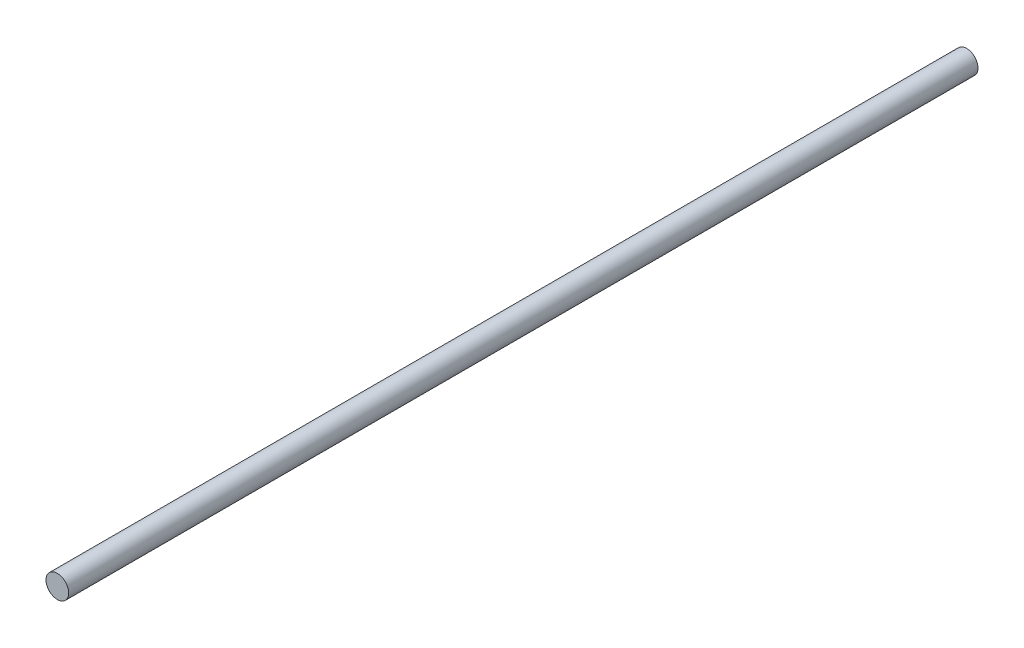
ISO-10303-21;
HEADER;
FILE_DESCRIPTION(('STEP AP214'),'2;1');
FILE_NAME('part.step','',(''),(''),'','','');
FILE_SCHEMA(('AUTOMOTIVE_DESIGN { 1 0 10303 214 1 1 1 1 }'));
ENDSEC;
DATA;
#1=APPLICATION_CONTEXT('core data for automotive mechanical design processes');
#2=APPLICATION_PROTOCOL_DEFINITION('international standard','automotive_design',2000,#1);
#3=PRODUCT_CONTEXT('',#1,'mechanical');
#4=PRODUCT('Part','Part','',(#3));
#5=PRODUCT_RELATED_PRODUCT_CATEGORY('part','',(#4));
#6=PRODUCT_DEFINITION_FORMATION('','',#4);
#7=PRODUCT_DEFINITION_CONTEXT('part definition',#1,'design');
#8=PRODUCT_DEFINITION('design','',#6,#7);
#9=PRODUCT_DEFINITION_SHAPE('','',#8);
#10=(LENGTH_UNIT() NAMED_UNIT(*) SI_UNIT(.MILLI.,.METRE.));
#11=(NAMED_UNIT(*) PLANE_ANGLE_UNIT() SI_UNIT($,.RADIAN.));
#12=(NAMED_UNIT(*) SI_UNIT($,.STERADIAN.) SOLID_ANGLE_UNIT());
#13=UNCERTAINTY_MEASURE_WITH_UNIT(LENGTH_MEASURE(1.E-05),#10,'distance_accuracy_value','');
#14=(GEOMETRIC_REPRESENTATION_CONTEXT(3) GLOBAL_UNCERTAINTY_ASSIGNED_CONTEXT((#13)) GLOBAL_UNIT_ASSIGNED_CONTEXT((#10,
#11,#12)) REPRESENTATION_CONTEXT('',''));
#15=CARTESIAN_POINT('',(0.,0.,0.));
#16=DIRECTION('',(0.,0.,1.));
#17=DIRECTION('',(1.,0.,0.));
#18=AXIS2_PLACEMENT_3D('',#15,#16,#17);
#19=CARTESIAN_POINT('',(0.,0.,800.));
#20=DIRECTION('',(0.,0.,-1.));
#21=DIRECTION('',(-1.,0.,0.));
#22=AXIS2_PLACEMENT_3D('',#19,#20,#21);
#23=CYLINDRICAL_SURFACE('',#22,10.);
#24=CARTESIAN_POINT('',(0.,0.,800.));
#25=DIRECTION('',(0.,0.,1.));
#26=DIRECTION('',(1.,0.,0.));
#27=AXIS2_PLACEMENT_3D('',#24,#25,#26);
#28=CIRCLE('',#27,10.);
#29=CARTESIAN_POINT('',(10.,0.,800.));
#30=VERTEX_POINT('',#29);
#31=EDGE_CURVE('E10',#30,#30,#28,.T.);
#32=ORIENTED_EDGE('',*,*,#31,.F.);
#33=EDGE_LOOP('',(#32));
#34=FACE_BOUND('',#33,.T.);
#35=CARTESIAN_POINT('',(0.,0.,0.));
#36=DIRECTION('',(0.,0.,1.));
#37=DIRECTION('',(1.,0.,0.));
#38=AXIS2_PLACEMENT_3D('',#35,#36,#37);
#39=CIRCLE('',#38,10.);
#40=CARTESIAN_POINT('',(10.,0.,0.));
#41=VERTEX_POINT('',#40);
#42=EDGE_CURVE('E35',#41,#41,#39,.T.);
#43=ORIENTED_EDGE('',*,*,#42,.T.);
#44=EDGE_LOOP('',(#43));
#45=FACE_BOUND('',#44,.T.);
#46=ADVANCED_FACE('F32',(#34,#45),#23,.T.);
#47=CARTESIAN_POINT('',(0.,0.,800.));
#48=DIRECTION('',(0.,0.,1.));
#49=DIRECTION('',(1.,0.,0.));
#50=AXIS2_PLACEMENT_3D('',#47,#48,#49);
#51=PLANE('',#50);
#52=ORIENTED_EDGE('',*,*,#31,.T.);
#53=EDGE_LOOP('',(#52));
#54=FACE_BOUND('',#53,.T.);
#55=ADVANCED_FACE('F47',(#54),#51,.T.);
#56=CARTESIAN_POINT('',(0.,0.,0.));
#57=DIRECTION('',(0.,0.,1.));
#58=DIRECTION('',(1.,0.,0.));
#59=AXIS2_PLACEMENT_3D('',#56,#57,#58);
#60=PLANE('',#59);
#61=ORIENTED_EDGE('',*,*,#42,.F.);
#62=EDGE_LOOP('',(#61));
#63=FACE_BOUND('',#62,.T.);
#64=ADVANCED_FACE('F45',(#63),#60,.F.);
#65=CLOSED_SHELL('',(#46,#55,#64));
#66=MANIFOLD_SOLID_BREP('B2',#65);
#67=ADVANCED_BREP_SHAPE_REPRESENTATION('',(#18,#66),#14);
#68=SHAPE_DEFINITION_REPRESENTATION(#9,#67);
ENDSEC;
END-ISO-10303-21;
